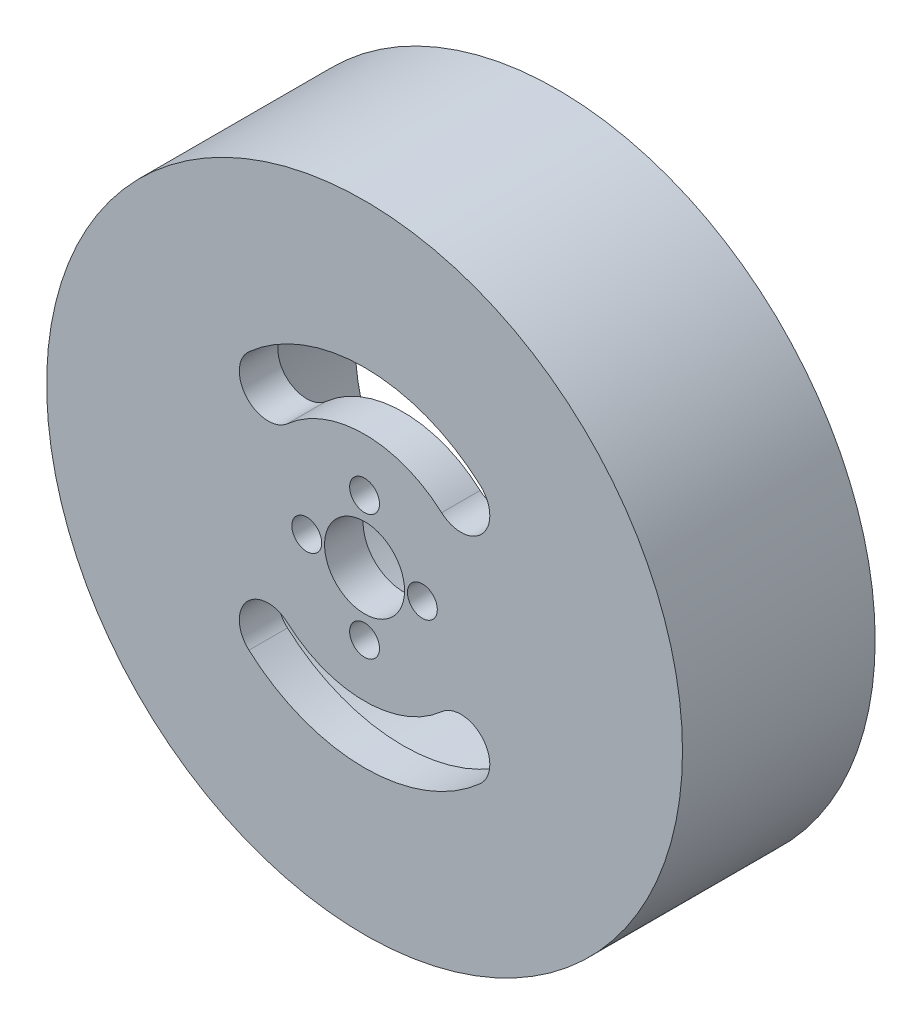
ISO-10303-21;
HEADER;
FILE_DESCRIPTION(('STEP AP214'),'2;1');
FILE_NAME('part.step','',(''),(''),'','','');
FILE_SCHEMA(('AUTOMOTIVE_DESIGN { 1 0 10303 214 1 1 1 1 }'));
ENDSEC;
DATA;
#1=APPLICATION_CONTEXT('core data for automotive mechanical design processes');
#2=APPLICATION_PROTOCOL_DEFINITION('international standard','automotive_design',2000,#1);
#3=PRODUCT_CONTEXT('',#1,'mechanical');
#4=PRODUCT('Part','Part','',(#3));
#5=PRODUCT_RELATED_PRODUCT_CATEGORY('part','',(#4));
#6=PRODUCT_DEFINITION_FORMATION('','',#4);
#7=PRODUCT_DEFINITION_CONTEXT('part definition',#1,'design');
#8=PRODUCT_DEFINITION('design','',#6,#7);
#9=PRODUCT_DEFINITION_SHAPE('','',#8);
#10=(LENGTH_UNIT() NAMED_UNIT(*) SI_UNIT(.MILLI.,.METRE.));
#11=(NAMED_UNIT(*) PLANE_ANGLE_UNIT() SI_UNIT($,.RADIAN.));
#12=(NAMED_UNIT(*) SI_UNIT($,.STERADIAN.) SOLID_ANGLE_UNIT());
#13=UNCERTAINTY_MEASURE_WITH_UNIT(LENGTH_MEASURE(1.E-05),#10,'distance_accuracy_value','');
#14=(GEOMETRIC_REPRESENTATION_CONTEXT(3) GLOBAL_UNCERTAINTY_ASSIGNED_CONTEXT((#13)) GLOBAL_UNIT_ASSIGNED_CONTEXT((#10,
#11,#12)) REPRESENTATION_CONTEXT('',''));
#15=CARTESIAN_POINT('',(0.,0.,0.));
#16=DIRECTION('',(0.,0.,1.));
#17=DIRECTION('',(1.,0.,0.));
#18=AXIS2_PLACEMENT_3D('',#15,#16,#17);
#19=CARTESIAN_POINT('',(0.,0.,20.));
#20=DIRECTION('',(0.,0.,1.));
#21=DIRECTION('',(1.,0.,0.));
#22=AXIS2_PLACEMENT_3D('',#19,#20,#21);
#23=PLANE('',#22);
#24=CARTESIAN_POINT('',(-6.,0.,20.));
#25=DIRECTION('',(0.,0.,1.));
#26=DIRECTION('',(1.,0.,0.));
#27=AXIS2_PLACEMENT_3D('',#24,#25,#26);
#28=CIRCLE('',#27,1.55);
#29=CARTESIAN_POINT('',(-4.45,0.,20.));
#30=VERTEX_POINT('',#29);
#31=EDGE_CURVE('E186',#30,#30,#28,.T.);
#32=ORIENTED_EDGE('',*,*,#31,.F.);
#33=EDGE_LOOP('',(#32));
#34=FACE_BOUND('',#33,.T.);
#35=CARTESIAN_POINT('',(0.,6.5,20.));
#36=DIRECTION('',(0.,0.,1.));
#37=DIRECTION('',(1.,0.,0.));
#38=AXIS2_PLACEMENT_3D('',#35,#36,#37);
#39=CIRCLE('',#38,1.55);
#40=CARTESIAN_POINT('',(1.55,6.5,20.));
#41=VERTEX_POINT('',#40);
#42=EDGE_CURVE('E174',#41,#41,#39,.T.);
#43=ORIENTED_EDGE('',*,*,#42,.F.);
#44=EDGE_LOOP('',(#43));
#45=FACE_BOUND('',#44,.T.);
#46=CARTESIAN_POINT('',(6.,0.,20.));
#47=DIRECTION('',(0.,0.,1.));
#48=DIRECTION('',(1.,0.,0.));
#49=AXIS2_PLACEMENT_3D('',#46,#47,#48);
#50=CIRCLE('',#49,1.55);
#51=CARTESIAN_POINT('',(7.55,0.,20.));
#52=VERTEX_POINT('',#51);
#53=EDGE_CURVE('E171',#52,#52,#50,.T.);
#54=ORIENTED_EDGE('',*,*,#53,.F.);
#55=EDGE_LOOP('',(#54));
#56=FACE_BOUND('',#55,.T.);
#57=CARTESIAN_POINT('',(0.,0.,20.));
#58=DIRECTION('',(0.,0.,1.));
#59=DIRECTION('',(1.,0.,0.));
#60=AXIS2_PLACEMENT_3D('',#57,#58,#59);
#61=CIRCLE('',#60,4.15);
#62=CARTESIAN_POINT('',(4.15,0.,20.));
#63=VERTEX_POINT('',#62);
#64=EDGE_CURVE('E168',#63,#63,#61,.T.);
#65=ORIENTED_EDGE('',*,*,#64,.F.);
#66=EDGE_LOOP('',(#65));
#67=FACE_BOUND('',#66,.T.);
#68=CARTESIAN_POINT('',(0.,-6.5,20.));
#69=DIRECTION('',(0.,0.,1.));
#70=DIRECTION('',(1.,0.,0.));
#71=AXIS2_PLACEMENT_3D('',#68,#69,#70);
#72=CIRCLE('',#71,1.55);
#73=CARTESIAN_POINT('',(1.55,-6.5,20.));
#74=VERTEX_POINT('',#73);
#75=EDGE_CURVE('E164',#74,#74,#72,.T.);
#76=ORIENTED_EDGE('',*,*,#75,.F.);
#77=EDGE_LOOP('',(#76));
#78=FACE_BOUND('',#77,.T.);
#79=CARTESIAN_POINT('',(10.,11.1803398874989,20.));
#80=DIRECTION('',(0.,0.,1.));
#81=DIRECTION('',(1.,0.,0.));
#82=AXIS2_PLACEMENT_3D('',#79,#80,#81);
#83=CIRCLE('',#82,3.);
#84=CARTESIAN_POINT('',(8.,8.94427190999916,20.));
#85=VERTEX_POINT('',#84);
#86=CARTESIAN_POINT('',(12.,13.4164078649987,20.));
#87=VERTEX_POINT('',#86);
#88=EDGE_CURVE('E153',#85,#87,#83,.T.);
#89=ORIENTED_EDGE('',*,*,#88,.F.);
#90=CARTESIAN_POINT('',(0.,0.,20.));
#91=DIRECTION('',(0.,0.,1.));
#92=DIRECTION('',(1.,0.,0.));
#93=AXIS2_PLACEMENT_3D('',#90,#91,#92);
#94=CIRCLE('',#93,12.);
#95=CARTESIAN_POINT('',(-8.,8.94427190999916,20.));
#96=VERTEX_POINT('',#95);
#97=EDGE_CURVE('E150',#85,#96,#94,.T.);
#98=ORIENTED_EDGE('',*,*,#97,.T.);
#99=CARTESIAN_POINT('',(-10.,11.1803398874989,20.));
#100=DIRECTION('',(0.,0.,1.));
#101=DIRECTION('',(1.,0.,0.));
#102=AXIS2_PLACEMENT_3D('',#99,#100,#101);
#103=CIRCLE('',#102,2.99999999999999);
#104=CARTESIAN_POINT('',(-12.,13.4164078649987,20.));
#105=VERTEX_POINT('',#104);
#106=EDGE_CURVE('E148',#105,#96,#103,.T.);
#107=ORIENTED_EDGE('',*,*,#106,.F.);
#108=CARTESIAN_POINT('',(0.,0.,20.));
#109=DIRECTION('',(0.,0.,1.));
#110=DIRECTION('',(1.,0.,0.));
#111=AXIS2_PLACEMENT_3D('',#108,#109,#110);
#112=CIRCLE('',#111,18.);
#113=EDGE_CURVE('E118',#87,#105,#112,.T.);
#114=ORIENTED_EDGE('',*,*,#113,.F.);
#115=EDGE_LOOP('',(#89,#98,#107,#114));
#116=FACE_BOUND('',#115,.T.);
#117=CARTESIAN_POINT('',(0.,0.,20.));
#118=DIRECTION('',(0.,0.,1.));
#119=DIRECTION('',(1.,0.,0.));
#120=AXIS2_PLACEMENT_3D('',#117,#118,#119);
#121=CIRCLE('',#120,33.);
#122=CARTESIAN_POINT('',(33.,0.,20.));
#123=VERTEX_POINT('',#122);
#124=EDGE_CURVE('E45',#123,#123,#121,.T.);
#125=ORIENTED_EDGE('',*,*,#124,.T.);
#126=EDGE_LOOP('',(#125));
#127=FACE_BOUND('',#126,.T.);
#128=CARTESIAN_POINT('',(-10.,-11.1803398874989,20.));
#129=DIRECTION('',(0.,0.,1.));
#130=DIRECTION('',(1.,0.,0.));
#131=AXIS2_PLACEMENT_3D('',#128,#129,#130);
#132=CIRCLE('',#131,2.99999999999999);
#133=CARTESIAN_POINT('',(-8.00000000000001,-8.94427190999916,20.));
#134=VERTEX_POINT('',#133);
#135=CARTESIAN_POINT('',(-12.,-13.4164078649987,20.));
#136=VERTEX_POINT('',#135);
#137=EDGE_CURVE('E135',#134,#136,#132,.T.);
#138=ORIENTED_EDGE('',*,*,#137,.F.);
#139=CARTESIAN_POINT('',(0.,0.,20.));
#140=DIRECTION('',(0.,0.,1.));
#141=DIRECTION('',(1.,0.,0.));
#142=AXIS2_PLACEMENT_3D('',#139,#140,#141);
#143=CIRCLE('',#142,12.);
#144=CARTESIAN_POINT('',(8.,-8.94427190999916,20.));
#145=VERTEX_POINT('',#144);
#146=EDGE_CURVE('E144',#134,#145,#143,.T.);
#147=ORIENTED_EDGE('',*,*,#146,.T.);
#148=CARTESIAN_POINT('',(10.,-11.1803398874989,20.));
#149=DIRECTION('',(0.,0.,1.));
#150=DIRECTION('',(1.,0.,0.));
#151=AXIS2_PLACEMENT_3D('',#148,#149,#150);
#152=CIRCLE('',#151,3.);
#153=CARTESIAN_POINT('',(12.,-13.4164078649987,20.));
#154=VERTEX_POINT('',#153);
#155=EDGE_CURVE('E141',#154,#145,#152,.T.);
#156=ORIENTED_EDGE('',*,*,#155,.F.);
#157=CARTESIAN_POINT('',(0.,0.,20.));
#158=DIRECTION('',(0.,0.,1.));
#159=DIRECTION('',(1.,0.,0.));
#160=AXIS2_PLACEMENT_3D('',#157,#158,#159);
#161=CIRCLE('',#160,18.);
#162=EDGE_CURVE('E138',#136,#154,#161,.T.);
#163=ORIENTED_EDGE('',*,*,#162,.F.);
#164=EDGE_LOOP('',(#138,#147,#156,#163));
#165=FACE_BOUND('',#164,.T.);
#166=ADVANCED_FACE('F36',(#34,#45,#56,#67,#78,#116,#127,#165),#23,.T.);
#167=CARTESIAN_POINT('',(0.,0.,0.));
#168=DIRECTION('',(0.,0.,1.));
#169=DIRECTION('',(1.,0.,0.));
#170=AXIS2_PLACEMENT_3D('',#167,#168,#169);
#171=PLANE('',#170);
#172=CARTESIAN_POINT('',(0.,0.,0.));
#173=DIRECTION('',(0.,0.,1.));
#174=DIRECTION('',(1.,0.,0.));
#175=AXIS2_PLACEMENT_3D('',#172,#173,#174);
#176=CIRCLE('',#175,21.);
#177=CARTESIAN_POINT('',(21.,0.,0.));
#178=VERTEX_POINT('',#177);
#179=EDGE_CURVE('E189',#178,#178,#176,.T.);
#180=ORIENTED_EDGE('',*,*,#179,.T.);
#181=EDGE_LOOP('',(#180));
#182=FACE_BOUND('',#181,.T.);
#183=CARTESIAN_POINT('',(0.,0.,0.));
#184=DIRECTION('',(0.,0.,1.));
#185=DIRECTION('',(1.,0.,0.));
#186=AXIS2_PLACEMENT_3D('',#183,#184,#185);
#187=CIRCLE('',#186,33.);
#188=CARTESIAN_POINT('',(33.,0.,0.));
#189=VERTEX_POINT('',#188);
#190=EDGE_CURVE('E156',#189,#189,#187,.T.);
#191=ORIENTED_EDGE('',*,*,#190,.F.);
#192=EDGE_LOOP('',(#191));
#193=FACE_BOUND('',#192,.T.);
#194=ADVANCED_FACE('F214',(#182,#193),#171,.F.);
#195=CARTESIAN_POINT('',(0.,0.,20.));
#196=DIRECTION('',(0.,0.,-1.));
#197=DIRECTION('',(-1.,0.,0.));
#198=AXIS2_PLACEMENT_3D('',#195,#196,#197);
#199=CYLINDRICAL_SURFACE('',#198,33.);
#200=ORIENTED_EDGE('',*,*,#124,.F.);
#201=EDGE_LOOP('',(#200));
#202=FACE_BOUND('',#201,.T.);
#203=ORIENTED_EDGE('',*,*,#190,.T.);
#204=EDGE_LOOP('',(#203));
#205=FACE_BOUND('',#204,.T.);
#206=ADVANCED_FACE('F38',(#202,#205),#199,.T.);
#207=CARTESIAN_POINT('',(0.,0.,-25.));
#208=DIRECTION('',(0.,0.,1.));
#209=DIRECTION('',(1.,0.,0.));
#210=AXIS2_PLACEMENT_3D('',#207,#208,#209);
#211=CYLINDRICAL_SURFACE('',#210,12.);
#212=CARTESIAN_POINT('',(0.,0.,16.));
#213=DIRECTION('',(0.,0.,1.));
#214=DIRECTION('',(1.,0.,0.));
#215=AXIS2_PLACEMENT_3D('',#212,#213,#214);
#216=CIRCLE('',#215,12.);
#217=CARTESIAN_POINT('',(8.,-8.94427190999916,16.));
#218=VERTEX_POINT('',#217);
#219=CARTESIAN_POINT('',(-8.00000000000001,-8.94427190999916,16.));
#220=VERTEX_POINT('',#219);
#221=EDGE_CURVE('E53',#218,#220,#216,.F.);
#222=ORIENTED_EDGE('',*,*,#221,.F.);
#223=DIRECTION('',(0.,0.,1.));
#224=VECTOR('',#223,1.);
#225=CARTESIAN_POINT('',(8.,-8.94427190999916,-25.));
#226=LINE('',#225,#224);
#227=EDGE_CURVE('E131',#218,#145,#226,.T.);
#228=ORIENTED_EDGE('',*,*,#227,.T.);
#229=ORIENTED_EDGE('',*,*,#146,.F.);
#230=DIRECTION('',(0.,0.,1.));
#231=VECTOR('',#230,1.);
#232=CARTESIAN_POINT('',(-8.00000000000001,-8.94427190999916,-25.));
#233=LINE('',#232,#231);
#234=EDGE_CURVE('E133',#220,#134,#233,.T.);
#235=ORIENTED_EDGE('',*,*,#234,.F.);
#236=EDGE_LOOP('',(#222,#228,#229,#235));
#237=FACE_BOUND('',#236,.T.);
#238=ADVANCED_FACE('F228',(#237),#211,.T.);
#239=CARTESIAN_POINT('',(10.,-11.1803398874989,-25.));
#240=DIRECTION('',(0.,0.,1.));
#241=DIRECTION('',(1.,0.,0.));
#242=AXIS2_PLACEMENT_3D('',#239,#240,#241);
#243=CYLINDRICAL_SURFACE('',#242,3.);
#244=ORIENTED_EDGE('',*,*,#227,.F.);
#245=CARTESIAN_POINT('',(10.,-11.1803398874989,16.));
#246=DIRECTION('',(0.,0.,1.));
#247=DIRECTION('',(1.,0.,0.));
#248=AXIS2_PLACEMENT_3D('',#245,#246,#247);
#249=CIRCLE('',#248,3.);
#250=CARTESIAN_POINT('',(12.,-13.4164078649987,16.));
#251=VERTEX_POINT('',#250);
#252=EDGE_CURVE('E201',#218,#251,#249,.F.);
#253=ORIENTED_EDGE('',*,*,#252,.T.);
#254=DIRECTION('',(0.,0.,1.));
#255=VECTOR('',#254,1.);
#256=CARTESIAN_POINT('',(12.,-13.4164078649987,-25.));
#257=LINE('',#256,#255);
#258=EDGE_CURVE('E129',#251,#154,#257,.T.);
#259=ORIENTED_EDGE('',*,*,#258,.T.);
#260=ORIENTED_EDGE('',*,*,#155,.T.);
#261=EDGE_LOOP('',(#244,#253,#259,#260));
#262=FACE_BOUND('',#261,.T.);
#263=ADVANCED_FACE('F231',(#262),#243,.F.);
#264=CARTESIAN_POINT('',(0.,0.,-25.));
#265=DIRECTION('',(0.,0.,1.));
#266=DIRECTION('',(1.,0.,0.));
#267=AXIS2_PLACEMENT_3D('',#264,#265,#266);
#268=CYLINDRICAL_SURFACE('',#267,18.);
#269=ORIENTED_EDGE('',*,*,#258,.F.);
#270=CARTESIAN_POINT('',(0.,0.,16.));
#271=DIRECTION('',(0.,0.,1.));
#272=DIRECTION('',(1.,0.,0.));
#273=AXIS2_PLACEMENT_3D('',#270,#271,#272);
#274=CIRCLE('',#273,18.);
#275=CARTESIAN_POINT('',(-12.,-13.4164078649987,16.));
#276=VERTEX_POINT('',#275);
#277=EDGE_CURVE('E198',#251,#276,#274,.F.);
#278=ORIENTED_EDGE('',*,*,#277,.T.);
#279=DIRECTION('',(0.,0.,1.));
#280=VECTOR('',#279,1.);
#281=CARTESIAN_POINT('',(-12.,-13.4164078649987,-25.));
#282=LINE('',#281,#280);
#283=EDGE_CURVE('E124',#276,#136,#282,.T.);
#284=ORIENTED_EDGE('',*,*,#283,.T.);
#285=ORIENTED_EDGE('',*,*,#162,.T.);
#286=EDGE_LOOP('',(#269,#278,#284,#285));
#287=FACE_BOUND('',#286,.T.);
#288=ADVANCED_FACE('F234',(#287),#268,.F.);
#289=CARTESIAN_POINT('',(-10.,-11.1803398874989,-25.));
#290=DIRECTION('',(0.,0.,1.));
#291=DIRECTION('',(1.,0.,0.));
#292=AXIS2_PLACEMENT_3D('',#289,#290,#291);
#293=CYLINDRICAL_SURFACE('',#292,2.99999999999999);
#294=ORIENTED_EDGE('',*,*,#283,.F.);
#295=CARTESIAN_POINT('',(-10.,-11.1803398874989,16.));
#296=DIRECTION('',(0.,0.,1.));
#297=DIRECTION('',(1.,0.,0.));
#298=AXIS2_PLACEMENT_3D('',#295,#296,#297);
#299=CIRCLE('',#298,2.99999999999999);
#300=EDGE_CURVE('E196',#276,#220,#299,.F.);
#301=ORIENTED_EDGE('',*,*,#300,.T.);
#302=ORIENTED_EDGE('',*,*,#234,.T.);
#303=ORIENTED_EDGE('',*,*,#137,.T.);
#304=EDGE_LOOP('',(#294,#301,#302,#303));
#305=FACE_BOUND('',#304,.T.);
#306=ADVANCED_FACE('F225',(#305),#293,.F.);
#307=CARTESIAN_POINT('',(10.,11.1803398874989,-25.));
#308=DIRECTION('',(0.,0.,1.));
#309=DIRECTION('',(1.,0.,0.));
#310=AXIS2_PLACEMENT_3D('',#307,#308,#309);
#311=CYLINDRICAL_SURFACE('',#310,3.);
#312=DIRECTION('',(0.,0.,1.));
#313=VECTOR('',#312,1.);
#314=CARTESIAN_POINT('',(12.,13.4164078649987,-25.));
#315=LINE('',#314,#313);
#316=CARTESIAN_POINT('',(12.,13.4164078649987,16.));
#317=VERTEX_POINT('',#316);
#318=EDGE_CURVE('E120',#317,#87,#315,.T.);
#319=ORIENTED_EDGE('',*,*,#318,.F.);
#320=CARTESIAN_POINT('',(10.,11.1803398874989,16.));
#321=DIRECTION('',(0.,0.,1.));
#322=DIRECTION('',(1.,0.,0.));
#323=AXIS2_PLACEMENT_3D('',#320,#321,#322);
#324=CIRCLE('',#323,3.);
#325=CARTESIAN_POINT('',(8.,8.94427190999916,16.));
#326=VERTEX_POINT('',#325);
#327=EDGE_CURVE('E61',#317,#326,#324,.F.);
#328=ORIENTED_EDGE('',*,*,#327,.T.);
#329=DIRECTION('',(0.,0.,1.));
#330=VECTOR('',#329,1.);
#331=CARTESIAN_POINT('',(8.,8.94427190999916,-25.));
#332=LINE('',#331,#330);
#333=EDGE_CURVE('E122',#326,#85,#332,.T.);
#334=ORIENTED_EDGE('',*,*,#333,.T.);
#335=ORIENTED_EDGE('',*,*,#88,.T.);
#336=EDGE_LOOP('',(#319,#328,#334,#335));
#337=FACE_BOUND('',#336,.T.);
#338=ADVANCED_FACE('F207',(#337),#311,.F.);
#339=CARTESIAN_POINT('',(0.,0.,-25.));
#340=DIRECTION('',(0.,0.,1.));
#341=DIRECTION('',(1.,0.,0.));
#342=AXIS2_PLACEMENT_3D('',#339,#340,#341);
#343=CYLINDRICAL_SURFACE('',#342,12.);
#344=CARTESIAN_POINT('',(0.,0.,16.));
#345=DIRECTION('',(0.,0.,1.));
#346=DIRECTION('',(1.,0.,0.));
#347=AXIS2_PLACEMENT_3D('',#344,#345,#346);
#348=CIRCLE('',#347,12.);
#349=CARTESIAN_POINT('',(-8.,8.94427190999916,16.));
#350=VERTEX_POINT('',#349);
#351=EDGE_CURVE('E113',#350,#326,#348,.F.);
#352=ORIENTED_EDGE('',*,*,#351,.F.);
#353=DIRECTION('',(0.,0.,1.));
#354=VECTOR('',#353,1.);
#355=CARTESIAN_POINT('',(-8.,8.94427190999916,-25.));
#356=LINE('',#355,#354);
#357=EDGE_CURVE('E112',#350,#96,#356,.T.);
#358=ORIENTED_EDGE('',*,*,#357,.T.);
#359=ORIENTED_EDGE('',*,*,#97,.F.);
#360=ORIENTED_EDGE('',*,*,#333,.F.);
#361=EDGE_LOOP('',(#352,#358,#359,#360));
#362=FACE_BOUND('',#361,.T.);
#363=ADVANCED_FACE('F210',(#362),#343,.T.);
#364=CARTESIAN_POINT('',(-10.,11.1803398874989,-25.));
#365=DIRECTION('',(0.,0.,1.));
#366=DIRECTION('',(1.,0.,0.));
#367=AXIS2_PLACEMENT_3D('',#364,#365,#366);
#368=CYLINDRICAL_SURFACE('',#367,2.99999999999999);
#369=ORIENTED_EDGE('',*,*,#357,.F.);
#370=CARTESIAN_POINT('',(-10.,11.1803398874989,16.));
#371=DIRECTION('',(0.,0.,1.));
#372=DIRECTION('',(1.,0.,0.));
#373=AXIS2_PLACEMENT_3D('',#370,#371,#372);
#374=CIRCLE('',#373,2.99999999999999);
#375=CARTESIAN_POINT('',(-12.,13.4164078649987,16.));
#376=VERTEX_POINT('',#375);
#377=EDGE_CURVE('E101',#350,#376,#374,.F.);
#378=ORIENTED_EDGE('',*,*,#377,.T.);
#379=DIRECTION('',(0.,0.,1.));
#380=VECTOR('',#379,1.);
#381=CARTESIAN_POINT('',(-12.,13.4164078649987,-25.));
#382=LINE('',#381,#380);
#383=EDGE_CURVE('E110',#376,#105,#382,.T.);
#384=ORIENTED_EDGE('',*,*,#383,.T.);
#385=ORIENTED_EDGE('',*,*,#106,.T.);
#386=EDGE_LOOP('',(#369,#378,#384,#385));
#387=FACE_BOUND('',#386,.T.);
#388=ADVANCED_FACE('F108',(#387),#368,.F.);
#389=CARTESIAN_POINT('',(0.,0.,-25.));
#390=DIRECTION('',(0.,0.,1.));
#391=DIRECTION('',(1.,0.,0.));
#392=AXIS2_PLACEMENT_3D('',#389,#390,#391);
#393=CYLINDRICAL_SURFACE('',#392,18.);
#394=ORIENTED_EDGE('',*,*,#383,.F.);
#395=CARTESIAN_POINT('',(0.,0.,16.));
#396=DIRECTION('',(0.,0.,1.));
#397=DIRECTION('',(1.,0.,0.));
#398=AXIS2_PLACEMENT_3D('',#395,#396,#397);
#399=CIRCLE('',#398,18.);
#400=EDGE_CURVE('E11',#376,#317,#399,.F.);
#401=ORIENTED_EDGE('',*,*,#400,.T.);
#402=ORIENTED_EDGE('',*,*,#318,.T.);
#403=ORIENTED_EDGE('',*,*,#113,.T.);
#404=EDGE_LOOP('',(#394,#401,#402,#403));
#405=FACE_BOUND('',#404,.T.);
#406=ADVANCED_FACE('F116',(#405),#393,.F.);
#407=CARTESIAN_POINT('',(0.,0.,16.));
#408=DIRECTION('',(0.,0.,1.));
#409=DIRECTION('',(1.,0.,0.));
#410=AXIS2_PLACEMENT_3D('',#407,#408,#409);
#411=PLANE('',#410);
#412=CARTESIAN_POINT('',(-6.,0.,16.));
#413=DIRECTION('',(0.,0.,1.));
#414=DIRECTION('',(1.,0.,0.));
#415=AXIS2_PLACEMENT_3D('',#412,#413,#414);
#416=CIRCLE('',#415,1.55);
#417=CARTESIAN_POINT('',(-4.45,0.,16.));
#418=VERTEX_POINT('',#417);
#419=EDGE_CURVE('E40',#418,#418,#416,.T.);
#420=ORIENTED_EDGE('',*,*,#419,.T.);
#421=EDGE_LOOP('',(#420));
#422=FACE_BOUND('',#421,.T.);
#423=CARTESIAN_POINT('',(0.,6.5,16.));
#424=DIRECTION('',(0.,0.,1.));
#425=DIRECTION('',(1.,0.,0.));
#426=AXIS2_PLACEMENT_3D('',#423,#424,#425);
#427=CIRCLE('',#426,1.55);
#428=CARTESIAN_POINT('',(1.55,6.5,16.));
#429=VERTEX_POINT('',#428);
#430=EDGE_CURVE('E172',#429,#429,#427,.T.);
#431=ORIENTED_EDGE('',*,*,#430,.T.);
#432=EDGE_LOOP('',(#431));
#433=FACE_BOUND('',#432,.T.);
#434=CARTESIAN_POINT('',(6.,0.,16.));
#435=DIRECTION('',(0.,0.,1.));
#436=DIRECTION('',(1.,0.,0.));
#437=AXIS2_PLACEMENT_3D('',#434,#435,#436);
#438=CIRCLE('',#437,1.55);
#439=CARTESIAN_POINT('',(7.55,0.,16.));
#440=VERTEX_POINT('',#439);
#441=EDGE_CURVE('E169',#440,#440,#438,.T.);
#442=ORIENTED_EDGE('',*,*,#441,.T.);
#443=EDGE_LOOP('',(#442));
#444=FACE_BOUND('',#443,.T.);
#445=CARTESIAN_POINT('',(0.,0.,16.));
#446=DIRECTION('',(0.,0.,1.));
#447=DIRECTION('',(1.,0.,0.));
#448=AXIS2_PLACEMENT_3D('',#445,#446,#447);
#449=CIRCLE('',#448,4.15);
#450=CARTESIAN_POINT('',(4.15,0.,16.));
#451=VERTEX_POINT('',#450);
#452=EDGE_CURVE('E165',#451,#451,#449,.T.);
#453=ORIENTED_EDGE('',*,*,#452,.T.);
#454=EDGE_LOOP('',(#453));
#455=FACE_BOUND('',#454,.T.);
#456=CARTESIAN_POINT('',(0.,-6.5,16.));
#457=DIRECTION('',(0.,0.,1.));
#458=DIRECTION('',(1.,0.,0.));
#459=AXIS2_PLACEMENT_3D('',#456,#457,#458);
#460=CIRCLE('',#459,1.55);
#461=CARTESIAN_POINT('',(1.55,-6.5,16.));
#462=VERTEX_POINT('',#461);
#463=EDGE_CURVE('E161',#462,#462,#460,.T.);
#464=ORIENTED_EDGE('',*,*,#463,.T.);
#465=EDGE_LOOP('',(#464));
#466=FACE_BOUND('',#465,.T.);
#467=ORIENTED_EDGE('',*,*,#221,.T.);
#468=ORIENTED_EDGE('',*,*,#300,.F.);
#469=ORIENTED_EDGE('',*,*,#277,.F.);
#470=ORIENTED_EDGE('',*,*,#252,.F.);
#471=EDGE_LOOP('',(#467,#468,#469,#470));
#472=FACE_BOUND('',#471,.T.);
#473=CARTESIAN_POINT('',(0.,0.,16.));
#474=DIRECTION('',(0.,0.,1.));
#475=DIRECTION('',(1.,0.,0.));
#476=AXIS2_PLACEMENT_3D('',#473,#474,#475);
#477=CIRCLE('',#476,21.);
#478=CARTESIAN_POINT('',(21.,0.,16.));
#479=VERTEX_POINT('',#478);
#480=EDGE_CURVE('E114',#479,#479,#477,.T.);
#481=ORIENTED_EDGE('',*,*,#480,.F.);
#482=EDGE_LOOP('',(#481));
#483=FACE_BOUND('',#482,.T.);
#484=ORIENTED_EDGE('',*,*,#400,.F.);
#485=ORIENTED_EDGE('',*,*,#377,.F.);
#486=ORIENTED_EDGE('',*,*,#351,.T.);
#487=ORIENTED_EDGE('',*,*,#327,.F.);
#488=EDGE_LOOP('',(#484,#485,#486,#487));
#489=FACE_BOUND('',#488,.T.);
#490=ADVANCED_FACE('F100',(#422,#433,#444,#455,#466,#472,#483,#489),#411,.F.);
#491=CARTESIAN_POINT('',(0.,0.,16.));
#492=DIRECTION('',(0.,0.,-1.));
#493=DIRECTION('',(-1.,0.,0.));
#494=AXIS2_PLACEMENT_3D('',#491,#492,#493);
#495=CYLINDRICAL_SURFACE('',#494,21.);
#496=ORIENTED_EDGE('',*,*,#480,.T.);
#497=EDGE_LOOP('',(#496));
#498=FACE_BOUND('',#497,.T.);
#499=ORIENTED_EDGE('',*,*,#179,.F.);
#500=EDGE_LOOP('',(#499));
#501=FACE_BOUND('',#500,.T.);
#502=ADVANCED_FACE('F237',(#498,#501),#495,.F.);
#503=CARTESIAN_POINT('',(0.,-6.5,-30.));
#504=DIRECTION('',(0.,0.,1.));
#505=DIRECTION('',(1.,0.,0.));
#506=AXIS2_PLACEMENT_3D('',#503,#504,#505);
#507=CYLINDRICAL_SURFACE('',#506,1.55);
#508=ORIENTED_EDGE('',*,*,#75,.T.);
#509=EDGE_LOOP('',(#508));
#510=FACE_BOUND('',#509,.T.);
#511=ORIENTED_EDGE('',*,*,#463,.F.);
#512=EDGE_LOOP('',(#511));
#513=FACE_BOUND('',#512,.T.);
#514=ADVANCED_FACE('F244',(#510,#513),#507,.F.);
#515=CARTESIAN_POINT('',(0.,0.,-30.));
#516=DIRECTION('',(0.,0.,1.));
#517=DIRECTION('',(1.,0.,0.));
#518=AXIS2_PLACEMENT_3D('',#515,#516,#517);
#519=CYLINDRICAL_SURFACE('',#518,4.15);
#520=ORIENTED_EDGE('',*,*,#64,.T.);
#521=EDGE_LOOP('',(#520));
#522=FACE_BOUND('',#521,.T.);
#523=ORIENTED_EDGE('',*,*,#452,.F.);
#524=EDGE_LOOP('',(#523));
#525=FACE_BOUND('',#524,.T.);
#526=ADVANCED_FACE('F275',(#522,#525),#519,.F.);
#527=CARTESIAN_POINT('',(6.,0.,-30.));
#528=DIRECTION('',(0.,0.,1.));
#529=DIRECTION('',(1.,0.,0.));
#530=AXIS2_PLACEMENT_3D('',#527,#528,#529);
#531=CYLINDRICAL_SURFACE('',#530,1.55);
#532=ORIENTED_EDGE('',*,*,#53,.T.);
#533=EDGE_LOOP('',(#532));
#534=FACE_BOUND('',#533,.T.);
#535=ORIENTED_EDGE('',*,*,#441,.F.);
#536=EDGE_LOOP('',(#535));
#537=FACE_BOUND('',#536,.T.);
#538=ADVANCED_FACE('F278',(#534,#537),#531,.F.);
#539=CARTESIAN_POINT('',(0.,6.5,-30.));
#540=DIRECTION('',(0.,0.,1.));
#541=DIRECTION('',(1.,0.,0.));
#542=AXIS2_PLACEMENT_3D('',#539,#540,#541);
#543=CYLINDRICAL_SURFACE('',#542,1.55);
#544=ORIENTED_EDGE('',*,*,#42,.T.);
#545=EDGE_LOOP('',(#544));
#546=FACE_BOUND('',#545,.T.);
#547=ORIENTED_EDGE('',*,*,#430,.F.);
#548=EDGE_LOOP('',(#547));
#549=FACE_BOUND('',#548,.T.);
#550=ADVANCED_FACE('F283',(#546,#549),#543,.F.);
#551=CARTESIAN_POINT('',(-6.,0.,-30.));
#552=DIRECTION('',(0.,0.,1.));
#553=DIRECTION('',(1.,0.,0.));
#554=AXIS2_PLACEMENT_3D('',#551,#552,#553);
#555=CYLINDRICAL_SURFACE('',#554,1.55);
#556=ORIENTED_EDGE('',*,*,#31,.T.);
#557=EDGE_LOOP('',(#556));
#558=FACE_BOUND('',#557,.T.);
#559=ORIENTED_EDGE('',*,*,#419,.F.);
#560=EDGE_LOOP('',(#559));
#561=FACE_BOUND('',#560,.T.);
#562=ADVANCED_FACE('F286',(#558,#561),#555,.F.);
#563=CLOSED_SHELL('',(#166,#194,#206,#238,#263,#288,#306,#338,#363,#388,#406,#490,#502,#514,
#526,#538,#550,#562));
#564=MANIFOLD_SOLID_BREP('B2',#563);
#565=ADVANCED_BREP_SHAPE_REPRESENTATION('',(#18,#564),#14);
#566=SHAPE_DEFINITION_REPRESENTATION(#9,#565);
ENDSEC;
END-ISO-10303-21;
